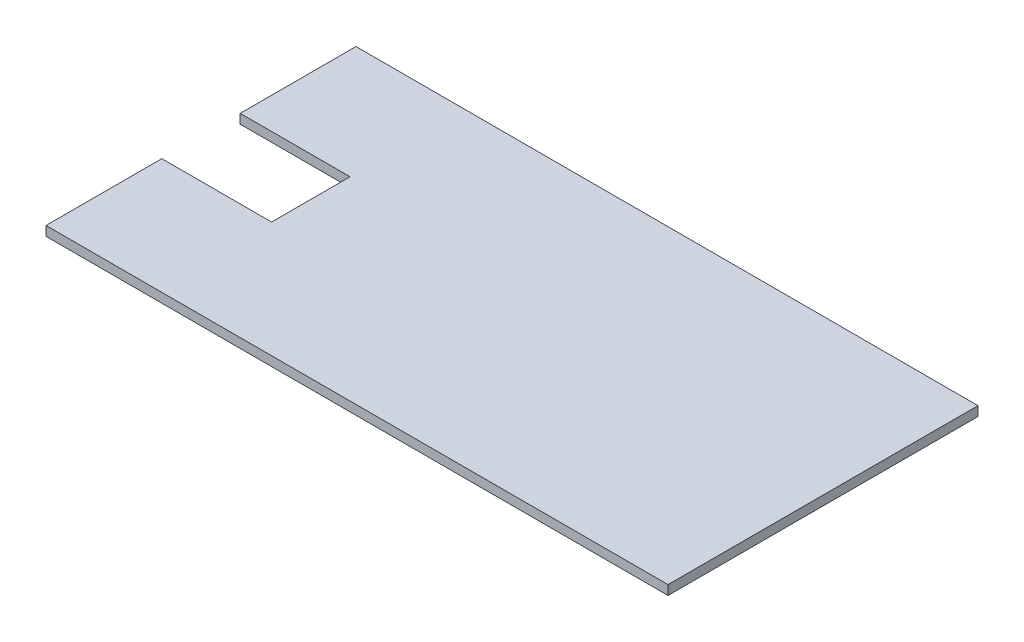
ISO-10303-21;
HEADER;
FILE_DESCRIPTION(('STEP AP214'),'2;1');
FILE_NAME('part.step','',(''),(''),'','','');
FILE_SCHEMA(('AUTOMOTIVE_DESIGN { 1 0 10303 214 1 1 1 1 }'));
ENDSEC;
DATA;
#1=APPLICATION_CONTEXT('core data for automotive mechanical design processes');
#2=APPLICATION_PROTOCOL_DEFINITION('international standard','automotive_design',2000,#1);
#3=PRODUCT_CONTEXT('',#1,'mechanical');
#4=PRODUCT('Part','Part','',(#3));
#5=PRODUCT_RELATED_PRODUCT_CATEGORY('part','',(#4));
#6=PRODUCT_DEFINITION_FORMATION('','',#4);
#7=PRODUCT_DEFINITION_CONTEXT('part definition',#1,'design');
#8=PRODUCT_DEFINITION('design','',#6,#7);
#9=PRODUCT_DEFINITION_SHAPE('','',#8);
#10=(LENGTH_UNIT() NAMED_UNIT(*) SI_UNIT(.MILLI.,.METRE.));
#11=(NAMED_UNIT(*) PLANE_ANGLE_UNIT() SI_UNIT($,.RADIAN.));
#12=(NAMED_UNIT(*) SI_UNIT($,.STERADIAN.) SOLID_ANGLE_UNIT());
#13=UNCERTAINTY_MEASURE_WITH_UNIT(LENGTH_MEASURE(1.E-05),#10,'distance_accuracy_value','');
#14=(GEOMETRIC_REPRESENTATION_CONTEXT(3) GLOBAL_UNCERTAINTY_ASSIGNED_CONTEXT((#13)) GLOBAL_UNIT_ASSIGNED_CONTEXT((#10,
#11,#12)) REPRESENTATION_CONTEXT('',''));
#15=CARTESIAN_POINT('',(0.,0.,0.));
#16=DIRECTION('',(0.,0.,1.));
#17=DIRECTION('',(1.,0.,0.));
#18=AXIS2_PLACEMENT_3D('',#15,#16,#17);
#19=CARTESIAN_POINT('',(-60.5781595623762,3.,-28.5039219437494));
#20=DIRECTION('',(1.,0.,0.));
#21=DIRECTION('',(0.,0.,-1.));
#22=AXIS2_PLACEMENT_3D('',#19,#20,#21);
#23=PLANE('',#22);
#24=DIRECTION('',(0.,0.,1.));
#25=VECTOR('',#24,1.);
#26=CARTESIAN_POINT('',(-60.5781595623762,0.,-28.5039219437494));
#27=LINE('',#26,#25);
#28=CARTESIAN_POINT('',(-60.5781595623762,0.,-28.5039219437494));
#29=VERTEX_POINT('',#28);
#30=CARTESIAN_POINT('',(-60.5781595623762,0.,8.39607805625067));
#31=VERTEX_POINT('',#30);
#32=EDGE_CURVE('E129',#29,#31,#27,.T.);
#33=ORIENTED_EDGE('',*,*,#32,.T.);
#34=DIRECTION('',(0.,-1.,0.));
#35=VECTOR('',#34,1.);
#36=CARTESIAN_POINT('',(-60.5781595623762,3.,8.39607805625067));
#37=LINE('',#36,#35);
#38=CARTESIAN_POINT('',(-60.5781595623762,3.,8.39607805625067));
#39=VERTEX_POINT('',#38);
#40=EDGE_CURVE('E11',#39,#31,#37,.T.);
#41=ORIENTED_EDGE('',*,*,#40,.F.);
#42=DIRECTION('',(0.,0.,1.));
#43=VECTOR('',#42,1.);
#44=CARTESIAN_POINT('',(-60.5781595623762,3.,-28.5039219437494));
#45=LINE('',#44,#43);
#46=CARTESIAN_POINT('',(-60.5781595623762,3.,-28.5039219437494));
#47=VERTEX_POINT('',#46);
#48=EDGE_CURVE('E143',#47,#39,#45,.T.);
#49=ORIENTED_EDGE('',*,*,#48,.F.);
#50=DIRECTION('',(0.,-1.,0.));
#51=VECTOR('',#50,1.);
#52=CARTESIAN_POINT('',(-60.5781595623762,3.,-28.5039219437494));
#53=LINE('',#52,#51);
#54=EDGE_CURVE('E125',#47,#29,#53,.T.);
#55=ORIENTED_EDGE('',*,*,#54,.T.);
#56=EDGE_LOOP('',(#33,#41,#49,#55));
#57=FACE_BOUND('',#56,.T.);
#58=ADVANCED_FACE('F33',(#57),#23,.F.);
#59=CARTESIAN_POINT('',(-60.5781595623762,3.,8.39607805625067));
#60=DIRECTION('',(0.,0.,-1.));
#61=DIRECTION('',(-1.,0.,0.));
#62=AXIS2_PLACEMENT_3D('',#59,#60,#61);
#63=PLANE('',#62);
#64=DIRECTION('',(1.,0.,0.));
#65=VECTOR('',#64,1.);
#66=CARTESIAN_POINT('',(-60.5781595623762,0.,8.39607805625067));
#67=LINE('',#66,#65);
#68=CARTESIAN_POINT('',(-25.5781595623762,0.,8.39607805625066));
#69=VERTEX_POINT('',#68);
#70=EDGE_CURVE('E132',#31,#69,#67,.T.);
#71=ORIENTED_EDGE('',*,*,#70,.T.);
#72=DIRECTION('',(0.,-1.,0.));
#73=VECTOR('',#72,1.);
#74=CARTESIAN_POINT('',(-25.5781595623762,3.,8.39607805625066));
#75=LINE('',#74,#73);
#76=CARTESIAN_POINT('',(-25.5781595623762,3.,8.39607805625066));
#77=VERTEX_POINT('',#76);
#78=EDGE_CURVE('E41',#77,#69,#75,.T.);
#79=ORIENTED_EDGE('',*,*,#78,.F.);
#80=DIRECTION('',(1.,0.,0.));
#81=VECTOR('',#80,1.);
#82=CARTESIAN_POINT('',(-60.5781595623762,3.,8.39607805625067));
#83=LINE('',#82,#81);
#84=EDGE_CURVE('E92',#39,#77,#83,.T.);
#85=ORIENTED_EDGE('',*,*,#84,.F.);
#86=ORIENTED_EDGE('',*,*,#40,.T.);
#87=EDGE_LOOP('',(#71,#79,#85,#86));
#88=FACE_BOUND('',#87,.T.);
#89=ADVANCED_FACE('F178',(#88),#63,.F.);
#90=CARTESIAN_POINT('',(-25.5781595623762,3.,8.39607805625066));
#91=DIRECTION('',(1.,0.,0.));
#92=DIRECTION('',(0.,0.,-1.));
#93=AXIS2_PLACEMENT_3D('',#90,#91,#92);
#94=PLANE('',#93);
#95=DIRECTION('',(0.,0.,1.));
#96=VECTOR('',#95,1.);
#97=CARTESIAN_POINT('',(-25.5781595623762,0.,8.39607805625066));
#98=LINE('',#97,#96);
#99=CARTESIAN_POINT('',(-25.5781595623762,0.,33.3960780562507));
#100=VERTEX_POINT('',#99);
#101=EDGE_CURVE('E134',#69,#100,#98,.T.);
#102=ORIENTED_EDGE('',*,*,#101,.T.);
#103=DIRECTION('',(0.,-1.,0.));
#104=VECTOR('',#103,1.);
#105=CARTESIAN_POINT('',(-25.5781595623762,3.,33.3960780562507));
#106=LINE('',#105,#104);
#107=CARTESIAN_POINT('',(-25.5781595623762,3.,33.3960780562507));
#108=VERTEX_POINT('',#107);
#109=EDGE_CURVE('E150',#108,#100,#106,.T.);
#110=ORIENTED_EDGE('',*,*,#109,.F.);
#111=DIRECTION('',(0.,0.,1.));
#112=VECTOR('',#111,1.);
#113=CARTESIAN_POINT('',(-25.5781595623762,3.,8.39607805625066));
#114=LINE('',#113,#112);
#115=EDGE_CURVE('E158',#77,#108,#114,.T.);
#116=ORIENTED_EDGE('',*,*,#115,.F.);
#117=ORIENTED_EDGE('',*,*,#78,.T.);
#118=EDGE_LOOP('',(#102,#110,#116,#117));
#119=FACE_BOUND('',#118,.T.);
#120=ADVANCED_FACE('F156',(#119),#94,.F.);
#121=CARTESIAN_POINT('',(-60.5781595623762,3.,33.3960780562507));
#122=DIRECTION('',(0.,0.,1.));
#123=DIRECTION('',(1.,0.,0.));
#124=AXIS2_PLACEMENT_3D('',#121,#122,#123);
#125=PLANE('',#124);
#126=DIRECTION('',(-1.,0.,0.));
#127=VECTOR('',#126,1.);
#128=CARTESIAN_POINT('',(-60.5781595623762,0.,33.3960780562507));
#129=LINE('',#128,#127);
#130=CARTESIAN_POINT('',(-60.5781595623762,0.,33.3960780562507));
#131=VERTEX_POINT('',#130);
#132=EDGE_CURVE('E136',#100,#131,#129,.T.);
#133=ORIENTED_EDGE('',*,*,#132,.T.);
#134=DIRECTION('',(0.,-1.,0.));
#135=VECTOR('',#134,1.);
#136=CARTESIAN_POINT('',(-60.5781595623762,3.,33.3960780562507));
#137=LINE('',#136,#135);
#138=CARTESIAN_POINT('',(-60.5781595623762,3.,33.3960780562507));
#139=VERTEX_POINT('',#138);
#140=EDGE_CURVE('E147',#139,#131,#137,.T.);
#141=ORIENTED_EDGE('',*,*,#140,.F.);
#142=DIRECTION('',(-1.,0.,0.));
#143=VECTOR('',#142,1.);
#144=CARTESIAN_POINT('',(-60.5781595623762,3.,33.3960780562507));
#145=LINE('',#144,#143);
#146=EDGE_CURVE('E170',#108,#139,#145,.T.);
#147=ORIENTED_EDGE('',*,*,#146,.F.);
#148=ORIENTED_EDGE('',*,*,#109,.T.);
#149=EDGE_LOOP('',(#133,#141,#147,#148));
#150=FACE_BOUND('',#149,.T.);
#151=ADVANCED_FACE('F166',(#150),#125,.F.);
#152=CARTESIAN_POINT('',(-60.5781595623762,3.,33.3960780562507));
#153=DIRECTION('',(1.,0.,0.));
#154=DIRECTION('',(0.,0.,-1.));
#155=AXIS2_PLACEMENT_3D('',#152,#153,#154);
#156=PLANE('',#155);
#157=DIRECTION('',(0.,0.,1.));
#158=VECTOR('',#157,1.);
#159=CARTESIAN_POINT('',(-60.5781595623762,0.,33.3960780562507));
#160=LINE('',#159,#158);
#161=CARTESIAN_POINT('',(-60.5781595623762,0.,70.2960780562506));
#162=VERTEX_POINT('',#161);
#163=EDGE_CURVE('E138',#131,#162,#160,.T.);
#164=ORIENTED_EDGE('',*,*,#163,.T.);
#165=DIRECTION('',(0.,-1.,0.));
#166=VECTOR('',#165,1.);
#167=CARTESIAN_POINT('',(-60.5781595623762,3.,70.2960780562506));
#168=LINE('',#167,#166);
#169=CARTESIAN_POINT('',(-60.5781595623762,3.,70.2960780562506));
#170=VERTEX_POINT('',#169);
#171=EDGE_CURVE('E120',#170,#162,#168,.T.);
#172=ORIENTED_EDGE('',*,*,#171,.F.);
#173=DIRECTION('',(0.,0.,1.));
#174=VECTOR('',#173,1.);
#175=CARTESIAN_POINT('',(-60.5781595623762,3.,33.3960780562507));
#176=LINE('',#175,#174);
#177=EDGE_CURVE('E111',#139,#170,#176,.T.);
#178=ORIENTED_EDGE('',*,*,#177,.F.);
#179=ORIENTED_EDGE('',*,*,#140,.T.);
#180=EDGE_LOOP('',(#164,#172,#178,#179));
#181=FACE_BOUND('',#180,.T.);
#182=ADVANCED_FACE('F169',(#181),#156,.F.);
#183=CARTESIAN_POINT('',(-60.5781595623762,3.,70.2960780562506));
#184=DIRECTION('',(0.,0.,-1.));
#185=DIRECTION('',(-1.,0.,0.));
#186=AXIS2_PLACEMENT_3D('',#183,#184,#185);
#187=PLANE('',#186);
#188=DIRECTION('',(1.,0.,0.));
#189=VECTOR('',#188,1.);
#190=CARTESIAN_POINT('',(-60.5781595623762,0.,70.2960780562506));
#191=LINE('',#190,#189);
#192=CARTESIAN_POINT('',(137.681840437624,0.,70.2960780562506));
#193=VERTEX_POINT('',#192);
#194=EDGE_CURVE('E119',#162,#193,#191,.T.);
#195=ORIENTED_EDGE('',*,*,#194,.T.);
#196=DIRECTION('',(0.,-1.,0.));
#197=VECTOR('',#196,1.);
#198=CARTESIAN_POINT('',(137.681840437624,3.,70.2960780562506));
#199=LINE('',#198,#197);
#200=CARTESIAN_POINT('',(137.681840437624,3.,70.2960780562506));
#201=VERTEX_POINT('',#200);
#202=EDGE_CURVE('E116',#201,#193,#199,.T.);
#203=ORIENTED_EDGE('',*,*,#202,.F.);
#204=DIRECTION('',(1.,0.,0.));
#205=VECTOR('',#204,1.);
#206=CARTESIAN_POINT('',(-60.5781595623762,3.,70.2960780562506));
#207=LINE('',#206,#205);
#208=EDGE_CURVE('E105',#170,#201,#207,.T.);
#209=ORIENTED_EDGE('',*,*,#208,.F.);
#210=ORIENTED_EDGE('',*,*,#171,.T.);
#211=EDGE_LOOP('',(#195,#203,#209,#210));
#212=FACE_BOUND('',#211,.T.);
#213=ADVANCED_FACE('F117',(#212),#187,.F.);
#214=CARTESIAN_POINT('',(137.681840437624,3.,-28.5039219437494));
#215=DIRECTION('',(-1.,0.,0.));
#216=DIRECTION('',(0.,0.,1.));
#217=AXIS2_PLACEMENT_3D('',#214,#215,#216);
#218=PLANE('',#217);
#219=DIRECTION('',(0.,0.,-1.));
#220=VECTOR('',#219,1.);
#221=CARTESIAN_POINT('',(137.681840437624,0.,-28.5039219437494));
#222=LINE('',#221,#220);
#223=CARTESIAN_POINT('',(137.681840437624,0.,-28.5039219437494));
#224=VERTEX_POINT('',#223);
#225=EDGE_CURVE('E78',#193,#224,#222,.T.);
#226=ORIENTED_EDGE('',*,*,#225,.T.);
#227=DIRECTION('',(0.,-1.,0.));
#228=VECTOR('',#227,1.);
#229=CARTESIAN_POINT('',(137.681840437624,3.,-28.5039219437494));
#230=LINE('',#229,#228);
#231=CARTESIAN_POINT('',(137.681840437624,3.,-28.5039219437494));
#232=VERTEX_POINT('',#231);
#233=EDGE_CURVE('E121',#232,#224,#230,.T.);
#234=ORIENTED_EDGE('',*,*,#233,.F.);
#235=DIRECTION('',(0.,0.,-1.));
#236=VECTOR('',#235,1.);
#237=CARTESIAN_POINT('',(137.681840437624,3.,-28.5039219437494));
#238=LINE('',#237,#236);
#239=EDGE_CURVE('E109',#201,#232,#238,.T.);
#240=ORIENTED_EDGE('',*,*,#239,.F.);
#241=ORIENTED_EDGE('',*,*,#202,.T.);
#242=EDGE_LOOP('',(#226,#234,#240,#241));
#243=FACE_BOUND('',#242,.T.);
#244=ADVANCED_FACE('F123',(#243),#218,.F.);
#245=CARTESIAN_POINT('',(-60.5781595623762,3.,-28.5039219437494));
#246=DIRECTION('',(0.,0.,1.));
#247=DIRECTION('',(1.,0.,0.));
#248=AXIS2_PLACEMENT_3D('',#245,#246,#247);
#249=PLANE('',#248);
#250=DIRECTION('',(-1.,0.,0.));
#251=VECTOR('',#250,1.);
#252=CARTESIAN_POINT('',(-60.5781595623762,0.,-28.5039219437494));
#253=LINE('',#252,#251);
#254=EDGE_CURVE('E84',#224,#29,#253,.T.);
#255=ORIENTED_EDGE('',*,*,#254,.T.);
#256=ORIENTED_EDGE('',*,*,#54,.F.);
#257=DIRECTION('',(-1.,0.,0.));
#258=VECTOR('',#257,1.);
#259=CARTESIAN_POINT('',(-60.5781595623762,3.,-28.5039219437494));
#260=LINE('',#259,#258);
#261=EDGE_CURVE('E49',#232,#47,#260,.T.);
#262=ORIENTED_EDGE('',*,*,#261,.F.);
#263=ORIENTED_EDGE('',*,*,#233,.T.);
#264=EDGE_LOOP('',(#255,#256,#262,#263));
#265=FACE_BOUND('',#264,.T.);
#266=ADVANCED_FACE('F194',(#265),#249,.F.);
#267=CARTESIAN_POINT('',(0.,3.,0.));
#268=DIRECTION('',(0.,1.,0.));
#269=DIRECTION('',(0.,0.,1.));
#270=AXIS2_PLACEMENT_3D('',#267,#268,#269);
#271=PLANE('',#270);
#272=ORIENTED_EDGE('',*,*,#48,.T.);
#273=ORIENTED_EDGE('',*,*,#84,.T.);
#274=ORIENTED_EDGE('',*,*,#115,.T.);
#275=ORIENTED_EDGE('',*,*,#146,.T.);
#276=ORIENTED_EDGE('',*,*,#177,.T.);
#277=ORIENTED_EDGE('',*,*,#208,.T.);
#278=ORIENTED_EDGE('',*,*,#239,.T.);
#279=ORIENTED_EDGE('',*,*,#261,.T.);
#280=EDGE_LOOP('',(#272,#273,#274,#275,#276,#277,#278,#279));
#281=FACE_BOUND('',#280,.T.);
#282=ADVANCED_FACE('F107',(#281),#271,.T.);
#283=CARTESIAN_POINT('',(0.,0.,0.));
#284=DIRECTION('',(0.,1.,0.));
#285=DIRECTION('',(0.,0.,1.));
#286=AXIS2_PLACEMENT_3D('',#283,#284,#285);
#287=PLANE('',#286);
#288=ORIENTED_EDGE('',*,*,#32,.F.);
#289=ORIENTED_EDGE('',*,*,#254,.F.);
#290=ORIENTED_EDGE('',*,*,#225,.F.);
#291=ORIENTED_EDGE('',*,*,#194,.F.);
#292=ORIENTED_EDGE('',*,*,#163,.F.);
#293=ORIENTED_EDGE('',*,*,#132,.F.);
#294=ORIENTED_EDGE('',*,*,#101,.F.);
#295=ORIENTED_EDGE('',*,*,#70,.F.);
#296=EDGE_LOOP('',(#288,#289,#290,#291,#292,#293,#294,#295));
#297=FACE_BOUND('',#296,.T.);
#298=ADVANCED_FACE('F162',(#297),#287,.F.);
#299=CLOSED_SHELL('',(#58,#89,#120,#151,#182,#213,#244,#266,#282,#298));
#300=MANIFOLD_SOLID_BREP('B2',#299);
#301=ADVANCED_BREP_SHAPE_REPRESENTATION('',(#18,#300),#14);
#302=SHAPE_DEFINITION_REPRESENTATION(#9,#301);
ENDSEC;
END-ISO-10303-21;
